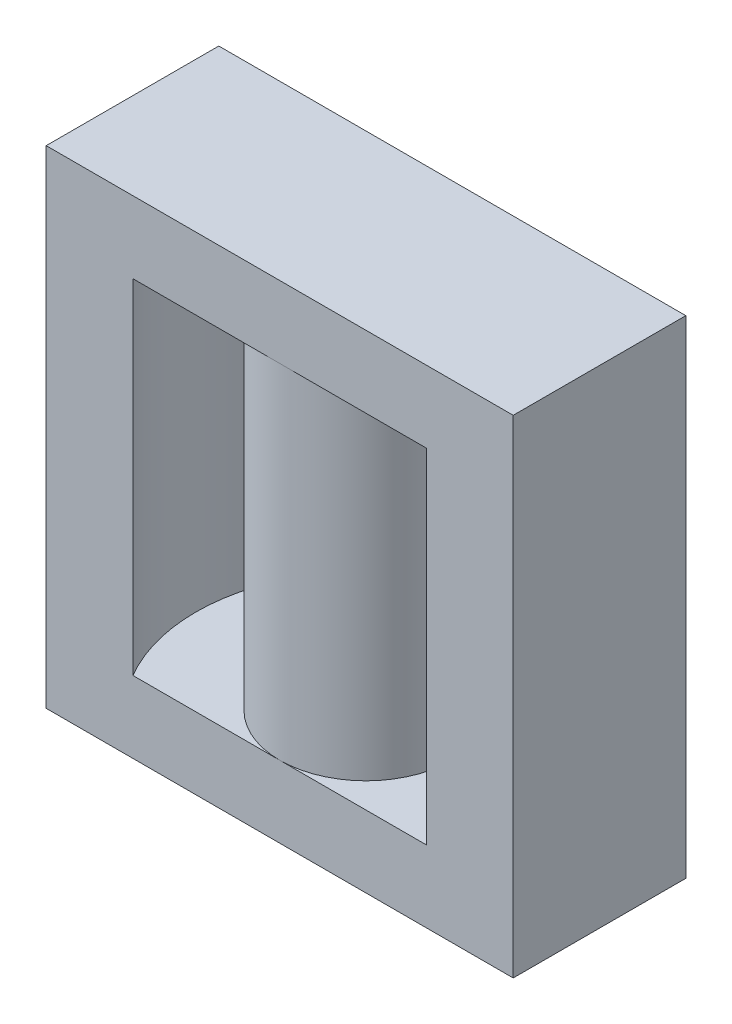
ISO-10303-21;
HEADER;
FILE_DESCRIPTION(('STEP AP214'),'2;1');
FILE_NAME('part.step','',(''),(''),'','','');
FILE_SCHEMA(('AUTOMOTIVE_DESIGN { 1 0 10303 214 1 1 1 1 }'));
ENDSEC;
DATA;
#1=APPLICATION_CONTEXT('core data for automotive mechanical design processes');
#2=APPLICATION_PROTOCOL_DEFINITION('international standard','automotive_design',2000,#1);
#3=PRODUCT_CONTEXT('',#1,'mechanical');
#4=PRODUCT('Part','Part','',(#3));
#5=PRODUCT_RELATED_PRODUCT_CATEGORY('part','',(#4));
#6=PRODUCT_DEFINITION_FORMATION('','',#4);
#7=PRODUCT_DEFINITION_CONTEXT('part definition',#1,'design');
#8=PRODUCT_DEFINITION('design','',#6,#7);
#9=PRODUCT_DEFINITION_SHAPE('','',#8);
#10=(LENGTH_UNIT() NAMED_UNIT(*) SI_UNIT(.MILLI.,.METRE.));
#11=(NAMED_UNIT(*) PLANE_ANGLE_UNIT() SI_UNIT($,.RADIAN.));
#12=(NAMED_UNIT(*) SI_UNIT($,.STERADIAN.) SOLID_ANGLE_UNIT());
#13=UNCERTAINTY_MEASURE_WITH_UNIT(LENGTH_MEASURE(1.E-05),#10,'distance_accuracy_value','');
#14=(GEOMETRIC_REPRESENTATION_CONTEXT(3) GLOBAL_UNCERTAINTY_ASSIGNED_CONTEXT((#13)) GLOBAL_UNIT_ASSIGNED_CONTEXT((#10,
#11,#12)) REPRESENTATION_CONTEXT('',''));
#15=CARTESIAN_POINT('',(0.,0.,0.));
#16=DIRECTION('',(0.,0.,1.));
#17=DIRECTION('',(1.,0.,0.));
#18=AXIS2_PLACEMENT_3D('',#15,#16,#17);
#19=CARTESIAN_POINT('',(0.,62.4,0.));
#20=DIRECTION('',(0.,-1.,0.));
#21=DIRECTION('',(0.,0.,-1.));
#22=AXIS2_PLACEMENT_3D('',#19,#20,#21);
#23=CYLINDRICAL_SURFACE('',#22,21.8);
#24=DIRECTION('',(0.,-1.,0.));
#25=VECTOR('',#24,1.);
#26=CARTESIAN_POINT('',(-18.7919530650755,62.4,11.05));
#27=LINE('',#26,#25);
#28=CARTESIAN_POINT('',(-18.7919530650755,53.2,11.05));
#29=VERTEX_POINT('',#28);
#30=CARTESIAN_POINT('',(-18.7919530650755,9.2,11.05));
#31=VERTEX_POINT('',#30);
#32=EDGE_CURVE('E131',#29,#31,#27,.T.);
#33=ORIENTED_EDGE('',*,*,#32,.T.);
#34=CARTESIAN_POINT('',(0.,9.2,0.));
#35=DIRECTION('',(0.,-1.,0.));
#36=DIRECTION('',(0.,0.,-1.));
#37=AXIS2_PLACEMENT_3D('',#34,#35,#36);
#38=CIRCLE('',#37,21.8);
#39=CARTESIAN_POINT('',(-18.7919530650755,9.2,-11.05));
#40=VERTEX_POINT('',#39);
#41=EDGE_CURVE('E118',#31,#40,#38,.T.);
#42=ORIENTED_EDGE('',*,*,#41,.T.);
#43=DIRECTION('',(0.,-1.,0.));
#44=VECTOR('',#43,1.);
#45=CARTESIAN_POINT('',(-18.7919530650755,62.4,-11.05));
#46=LINE('',#45,#44);
#47=CARTESIAN_POINT('',(-18.7919530650755,53.2,-11.05));
#48=VERTEX_POINT('',#47);
#49=EDGE_CURVE('E128',#48,#40,#46,.T.);
#50=ORIENTED_EDGE('',*,*,#49,.F.);
#51=CARTESIAN_POINT('',(0.,53.2,0.));
#52=DIRECTION('',(0.,1.,0.));
#53=DIRECTION('',(0.,0.,1.));
#54=AXIS2_PLACEMENT_3D('',#51,#52,#53);
#55=CIRCLE('',#54,21.8);
#56=EDGE_CURVE('E162',#48,#29,#55,.T.);
#57=ORIENTED_EDGE('',*,*,#56,.T.);
#58=EDGE_LOOP('',(#33,#42,#50,#57));
#59=FACE_BOUND('',#58,.T.);
#60=ADVANCED_FACE('F38',(#59),#23,.F.);
#61=CARTESIAN_POINT('',(0.,62.4,0.));
#62=DIRECTION('',(0.,-1.,0.));
#63=DIRECTION('',(0.,0.,-1.));
#64=AXIS2_PLACEMENT_3D('',#61,#62,#63);
#65=CYLINDRICAL_SURFACE('',#64,11.05);
#66=CARTESIAN_POINT('',(0.,53.2,0.));
#67=DIRECTION('',(0.,1.,0.));
#68=DIRECTION('',(0.,0.,1.));
#69=AXIS2_PLACEMENT_3D('',#66,#67,#68);
#70=CIRCLE('',#69,11.05);
#71=CARTESIAN_POINT('',(0.,53.2,-11.05));
#72=VERTEX_POINT('',#71);
#73=CARTESIAN_POINT('',(0.,53.2,11.05));
#74=VERTEX_POINT('',#73);
#75=EDGE_CURVE('E139',#72,#74,#70,.F.);
#76=ORIENTED_EDGE('',*,*,#75,.T.);
#77=EDGE_CURVE('E143',#74,#72,#70,.F.);
#78=ORIENTED_EDGE('',*,*,#77,.T.);
#79=EDGE_LOOP('',(#76,#78));
#80=FACE_BOUND('',#79,.T.);
#81=CARTESIAN_POINT('',(0.,9.2,0.));
#82=DIRECTION('',(0.,-1.,0.));
#83=DIRECTION('',(0.,0.,-1.));
#84=AXIS2_PLACEMENT_3D('',#81,#82,#83);
#85=CIRCLE('',#84,11.05);
#86=CARTESIAN_POINT('',(0.,9.2,-11.05));
#87=VERTEX_POINT('',#86);
#88=CARTESIAN_POINT('',(0.,9.2,11.05));
#89=VERTEX_POINT('',#88);
#90=EDGE_CURVE('E133',#87,#89,#85,.T.);
#91=ORIENTED_EDGE('',*,*,#90,.F.);
#92=EDGE_CURVE('E51',#89,#87,#85,.T.);
#93=ORIENTED_EDGE('',*,*,#92,.F.);
#94=EDGE_LOOP('',(#91,#93));
#95=FACE_BOUND('',#94,.T.);
#96=ADVANCED_FACE('F156',(#80,#95),#65,.T.);
#97=CARTESIAN_POINT('',(0.,62.4,0.));
#98=DIRECTION('',(0.,-1.,0.));
#99=DIRECTION('',(0.,0.,-1.));
#100=AXIS2_PLACEMENT_3D('',#97,#98,#99);
#101=CYLINDRICAL_SURFACE('',#100,21.8);
#102=DIRECTION('',(0.,-1.,0.));
#103=VECTOR('',#102,1.);
#104=CARTESIAN_POINT('',(18.7919530650755,62.4,-11.05));
#105=LINE('',#104,#103);
#106=CARTESIAN_POINT('',(18.7919530650755,53.2,-11.05));
#107=VERTEX_POINT('',#106);
#108=CARTESIAN_POINT('',(18.7919530650755,9.2,-11.05));
#109=VERTEX_POINT('',#108);
#110=EDGE_CURVE('E59',#107,#109,#105,.T.);
#111=ORIENTED_EDGE('',*,*,#110,.T.);
#112=CARTESIAN_POINT('',(0.,9.2,0.));
#113=DIRECTION('',(0.,-1.,0.));
#114=DIRECTION('',(0.,0.,-1.));
#115=AXIS2_PLACEMENT_3D('',#112,#113,#114);
#116=CIRCLE('',#115,21.8);
#117=CARTESIAN_POINT('',(18.7919530650755,9.2,11.05));
#118=VERTEX_POINT('',#117);
#119=EDGE_CURVE('E11',#109,#118,#116,.T.);
#120=ORIENTED_EDGE('',*,*,#119,.T.);
#121=DIRECTION('',(0.,-1.,0.));
#122=VECTOR('',#121,1.);
#123=CARTESIAN_POINT('',(18.7919530650755,62.4,11.05));
#124=LINE('',#123,#122);
#125=CARTESIAN_POINT('',(18.7919530650755,53.2,11.05));
#126=VERTEX_POINT('',#125);
#127=EDGE_CURVE('E173',#126,#118,#124,.T.);
#128=ORIENTED_EDGE('',*,*,#127,.F.);
#129=CARTESIAN_POINT('',(0.,53.2,0.));
#130=DIRECTION('',(0.,1.,0.));
#131=DIRECTION('',(0.,0.,1.));
#132=AXIS2_PLACEMENT_3D('',#129,#130,#131);
#133=CIRCLE('',#132,21.8);
#134=EDGE_CURVE('E45',#107,#126,#133,.F.);
#135=ORIENTED_EDGE('',*,*,#134,.F.);
#136=EDGE_LOOP('',(#111,#120,#128,#135));
#137=FACE_BOUND('',#136,.T.);
#138=ADVANCED_FACE('F218',(#137),#101,.F.);
#139=CARTESIAN_POINT('',(0.,53.2,0.));
#140=DIRECTION('',(0.,1.,0.));
#141=DIRECTION('',(0.,0.,1.));
#142=AXIS2_PLACEMENT_3D('',#139,#140,#141);
#143=PLANE('',#142);
#144=ORIENTED_EDGE('',*,*,#77,.F.);
#145=DIRECTION('',(1.,0.,0.));
#146=VECTOR('',#145,1.);
#147=CARTESIAN_POINT('',(-29.9,53.2,11.05));
#148=LINE('',#147,#146);
#149=EDGE_CURVE('E161',#29,#74,#148,.T.);
#150=ORIENTED_EDGE('',*,*,#149,.F.);
#151=ORIENTED_EDGE('',*,*,#56,.F.);
#152=DIRECTION('',(-1.,0.,0.));
#153=VECTOR('',#152,1.);
#154=CARTESIAN_POINT('',(-29.9,53.2,-11.05));
#155=LINE('',#154,#153);
#156=EDGE_CURVE('E138',#72,#48,#155,.T.);
#157=ORIENTED_EDGE('',*,*,#156,.F.);
#158=EDGE_LOOP('',(#144,#150,#151,#157));
#159=FACE_BOUND('',#158,.T.);
#160=ADVANCED_FACE('F160',(#159),#143,.F.);
#161=CARTESIAN_POINT('',(0.,62.4,-11.05));
#162=DIRECTION('',(0.,0.,-1.));
#163=DIRECTION('',(-1.,0.,0.));
#164=AXIS2_PLACEMENT_3D('',#161,#162,#163);
#165=PLANE('',#164);
#166=ORIENTED_EDGE('',*,*,#49,.T.);
#167=DIRECTION('',(1.,0.,0.));
#168=VECTOR('',#167,1.);
#169=CARTESIAN_POINT('',(-29.9,9.2,-11.05));
#170=LINE('',#169,#168);
#171=EDGE_CURVE('E114',#40,#87,#170,.T.);
#172=ORIENTED_EDGE('',*,*,#171,.T.);
#173=EDGE_CURVE('E123',#87,#109,#170,.T.);
#174=ORIENTED_EDGE('',*,*,#173,.T.);
#175=ORIENTED_EDGE('',*,*,#110,.F.);
#176=EDGE_CURVE('E163',#107,#72,#155,.T.);
#177=ORIENTED_EDGE('',*,*,#176,.T.);
#178=ORIENTED_EDGE('',*,*,#156,.T.);
#179=EDGE_LOOP('',(#166,#172,#174,#175,#177,#178));
#180=FACE_BOUND('',#179,.T.);
#181=DIRECTION('',(1.,0.,0.));
#182=VECTOR('',#181,1.);
#183=CARTESIAN_POINT('',(0.,0.,-11.05));
#184=LINE('',#183,#182);
#185=CARTESIAN_POINT('',(-29.9,0.,-11.05));
#186=VERTEX_POINT('',#185);
#187=CARTESIAN_POINT('',(29.9,0.,-11.05));
#188=VERTEX_POINT('',#187);
#189=EDGE_CURVE('E178',#186,#188,#184,.T.);
#190=ORIENTED_EDGE('',*,*,#189,.F.);
#191=DIRECTION('',(0.,-1.,0.));
#192=VECTOR('',#191,1.);
#193=CARTESIAN_POINT('',(-29.9,62.4,-11.05));
#194=LINE('',#193,#192);
#195=CARTESIAN_POINT('',(-29.9,62.4,-11.05));
#196=VERTEX_POINT('',#195);
#197=EDGE_CURVE('E140',#196,#186,#194,.T.);
#198=ORIENTED_EDGE('',*,*,#197,.F.);
#199=DIRECTION('',(1.,0.,0.));
#200=VECTOR('',#199,1.);
#201=CARTESIAN_POINT('',(0.,62.4,-11.05));
#202=LINE('',#201,#200);
#203=CARTESIAN_POINT('',(29.9,62.4,-11.05));
#204=VERTEX_POINT('',#203);
#205=EDGE_CURVE('E179',#196,#204,#202,.T.);
#206=ORIENTED_EDGE('',*,*,#205,.T.);
#207=DIRECTION('',(0.,1.,0.));
#208=VECTOR('',#207,1.);
#209=CARTESIAN_POINT('',(29.9,53.2,-11.05));
#210=LINE('',#209,#208);
#211=EDGE_CURVE('E174',#188,#204,#210,.T.);
#212=ORIENTED_EDGE('',*,*,#211,.F.);
#213=EDGE_LOOP('',(#190,#198,#206,#212));
#214=FACE_BOUND('',#213,.T.);
#215=ADVANCED_FACE('F135',(#180,#214),#165,.T.);
#216=CARTESIAN_POINT('',(-29.9,62.4,0.));
#217=DIRECTION('',(1.,0.,0.));
#218=DIRECTION('',(0.,0.,-1.));
#219=AXIS2_PLACEMENT_3D('',#216,#217,#218);
#220=PLANE('',#219);
#221=DIRECTION('',(0.,0.,1.));
#222=VECTOR('',#221,1.);
#223=CARTESIAN_POINT('',(-29.9,0.,0.));
#224=LINE('',#223,#222);
#225=CARTESIAN_POINT('',(-29.9,0.,11.05));
#226=VERTEX_POINT('',#225);
#227=EDGE_CURVE('E189',#186,#226,#224,.T.);
#228=ORIENTED_EDGE('',*,*,#227,.T.);
#229=DIRECTION('',(0.,-1.,0.));
#230=VECTOR('',#229,1.);
#231=CARTESIAN_POINT('',(-29.9,62.4,11.05));
#232=LINE('',#231,#230);
#233=CARTESIAN_POINT('',(-29.9,62.4,11.05));
#234=VERTEX_POINT('',#233);
#235=EDGE_CURVE('E145',#234,#226,#232,.T.);
#236=ORIENTED_EDGE('',*,*,#235,.F.);
#237=DIRECTION('',(0.,0.,1.));
#238=VECTOR('',#237,1.);
#239=CARTESIAN_POINT('',(-29.9,62.4,0.));
#240=LINE('',#239,#238);
#241=EDGE_CURVE('E182',#196,#234,#240,.T.);
#242=ORIENTED_EDGE('',*,*,#241,.F.);
#243=ORIENTED_EDGE('',*,*,#197,.T.);
#244=EDGE_LOOP('',(#228,#236,#242,#243));
#245=FACE_BOUND('',#244,.T.);
#246=ADVANCED_FACE('F203',(#245),#220,.F.);
#247=CARTESIAN_POINT('',(0.,62.4,11.05));
#248=DIRECTION('',(0.,0.,-1.));
#249=DIRECTION('',(-1.,0.,0.));
#250=AXIS2_PLACEMENT_3D('',#247,#248,#249);
#251=PLANE('',#250);
#252=DIRECTION('',(1.,0.,0.));
#253=VECTOR('',#252,1.);
#254=CARTESIAN_POINT('',(0.,0.,11.05));
#255=LINE('',#254,#253);
#256=CARTESIAN_POINT('',(29.9,0.,11.05));
#257=VERTEX_POINT('',#256);
#258=EDGE_CURVE('E183',#226,#257,#255,.T.);
#259=ORIENTED_EDGE('',*,*,#258,.T.);
#260=DIRECTION('',(0.,1.,0.));
#261=VECTOR('',#260,1.);
#262=CARTESIAN_POINT('',(29.9,53.2,11.05));
#263=LINE('',#262,#261);
#264=CARTESIAN_POINT('',(29.9,62.4,11.05));
#265=VERTEX_POINT('',#264);
#266=EDGE_CURVE('E165',#257,#265,#263,.T.);
#267=ORIENTED_EDGE('',*,*,#266,.T.);
#268=DIRECTION('',(1.,0.,0.));
#269=VECTOR('',#268,1.);
#270=CARTESIAN_POINT('',(0.,62.4,11.05));
#271=LINE('',#270,#269);
#272=EDGE_CURVE('E185',#234,#265,#271,.T.);
#273=ORIENTED_EDGE('',*,*,#272,.F.);
#274=ORIENTED_EDGE('',*,*,#235,.T.);
#275=EDGE_LOOP('',(#259,#267,#273,#274));
#276=FACE_BOUND('',#275,.T.);
#277=DIRECTION('',(-1.,0.,0.));
#278=VECTOR('',#277,1.);
#279=CARTESIAN_POINT('',(-29.9,9.2,11.05));
#280=LINE('',#279,#278);
#281=EDGE_CURVE('E122',#89,#31,#280,.T.);
#282=ORIENTED_EDGE('',*,*,#281,.T.);
#283=ORIENTED_EDGE('',*,*,#32,.F.);
#284=ORIENTED_EDGE('',*,*,#149,.T.);
#285=EDGE_CURVE('E166',#74,#126,#148,.T.);
#286=ORIENTED_EDGE('',*,*,#285,.T.);
#287=ORIENTED_EDGE('',*,*,#127,.T.);
#288=EDGE_CURVE('E216',#118,#89,#280,.T.);
#289=ORIENTED_EDGE('',*,*,#288,.T.);
#290=EDGE_LOOP('',(#282,#283,#284,#286,#287,#289));
#291=FACE_BOUND('',#290,.T.);
#292=ADVANCED_FACE('F196',(#276,#291),#251,.F.);
#293=CARTESIAN_POINT('',(0.,62.4,0.));
#294=DIRECTION('',(0.,1.,0.));
#295=DIRECTION('',(0.,0.,1.));
#296=AXIS2_PLACEMENT_3D('',#293,#294,#295);
#297=PLANE('',#296);
#298=ORIENTED_EDGE('',*,*,#272,.T.);
#299=DIRECTION('',(0.,0.,-1.));
#300=VECTOR('',#299,1.);
#301=CARTESIAN_POINT('',(29.9,62.4,-11.05));
#302=LINE('',#301,#300);
#303=EDGE_CURVE('E170',#265,#204,#302,.T.);
#304=ORIENTED_EDGE('',*,*,#303,.T.);
#305=ORIENTED_EDGE('',*,*,#205,.F.);
#306=ORIENTED_EDGE('',*,*,#241,.T.);
#307=EDGE_LOOP('',(#298,#304,#305,#306));
#308=FACE_BOUND('',#307,.T.);
#309=ADVANCED_FACE('F266',(#308),#297,.T.);
#310=CARTESIAN_POINT('',(0.,0.,0.));
#311=DIRECTION('',(0.,1.,0.));
#312=DIRECTION('',(0.,0.,1.));
#313=AXIS2_PLACEMENT_3D('',#310,#311,#312);
#314=PLANE('',#313);
#315=ORIENTED_EDGE('',*,*,#189,.T.);
#316=DIRECTION('',(0.,0.,1.));
#317=VECTOR('',#316,1.);
#318=CARTESIAN_POINT('',(29.9,0.,0.));
#319=LINE('',#318,#317);
#320=EDGE_CURVE('E132',#188,#257,#319,.T.);
#321=ORIENTED_EDGE('',*,*,#320,.T.);
#322=ORIENTED_EDGE('',*,*,#258,.F.);
#323=ORIENTED_EDGE('',*,*,#227,.F.);
#324=EDGE_LOOP('',(#315,#321,#322,#323));
#325=FACE_BOUND('',#324,.T.);
#326=ADVANCED_FACE('F207',(#325),#314,.F.);
#327=CARTESIAN_POINT('',(29.9,53.2,-11.05));
#328=DIRECTION('',(1.,0.,0.));
#329=DIRECTION('',(0.,0.,-1.));
#330=AXIS2_PLACEMENT_3D('',#327,#328,#329);
#331=PLANE('',#330);
#332=ORIENTED_EDGE('',*,*,#211,.T.);
#333=ORIENTED_EDGE('',*,*,#303,.F.);
#334=ORIENTED_EDGE('',*,*,#266,.F.);
#335=ORIENTED_EDGE('',*,*,#320,.F.);
#336=EDGE_LOOP('',(#332,#333,#334,#335));
#337=FACE_BOUND('',#336,.T.);
#338=ADVANCED_FACE('F224',(#337),#331,.T.);
#339=ORIENTED_EDGE('',*,*,#176,.F.);
#340=ORIENTED_EDGE('',*,*,#134,.T.);
#341=ORIENTED_EDGE('',*,*,#285,.F.);
#342=ORIENTED_EDGE('',*,*,#75,.F.);
#343=EDGE_LOOP('',(#339,#340,#341,#342));
#344=FACE_BOUND('',#343,.T.);
#345=ADVANCED_FACE('F222',(#344),#143,.F.);
#346=CARTESIAN_POINT('',(0.,9.2,0.));
#347=DIRECTION('',(0.,-1.,0.));
#348=DIRECTION('',(0.,0.,-1.));
#349=AXIS2_PLACEMENT_3D('',#346,#347,#348);
#350=PLANE('',#349);
#351=ORIENTED_EDGE('',*,*,#41,.F.);
#352=ORIENTED_EDGE('',*,*,#281,.F.);
#353=ORIENTED_EDGE('',*,*,#92,.T.);
#354=ORIENTED_EDGE('',*,*,#171,.F.);
#355=EDGE_LOOP('',(#351,#352,#353,#354));
#356=FACE_BOUND('',#355,.T.);
#357=ADVANCED_FACE('F116',(#356),#350,.F.);
#358=ORIENTED_EDGE('',*,*,#173,.F.);
#359=ORIENTED_EDGE('',*,*,#90,.T.);
#360=ORIENTED_EDGE('',*,*,#288,.F.);
#361=ORIENTED_EDGE('',*,*,#119,.F.);
#362=EDGE_LOOP('',(#358,#359,#360,#361));
#363=FACE_BOUND('',#362,.T.);
#364=ADVANCED_FACE('F220',(#363),#350,.F.);
#365=CLOSED_SHELL('',(#60,#96,#138,#160,#215,#246,#292,#309,#326,#338,#345,#357,#364));
#366=MANIFOLD_SOLID_BREP('B2',#365);
#367=ADVANCED_BREP_SHAPE_REPRESENTATION('',(#18,#366),#14);
#368=SHAPE_DEFINITION_REPRESENTATION(#9,#367);
ENDSEC;
END-ISO-10303-21;
